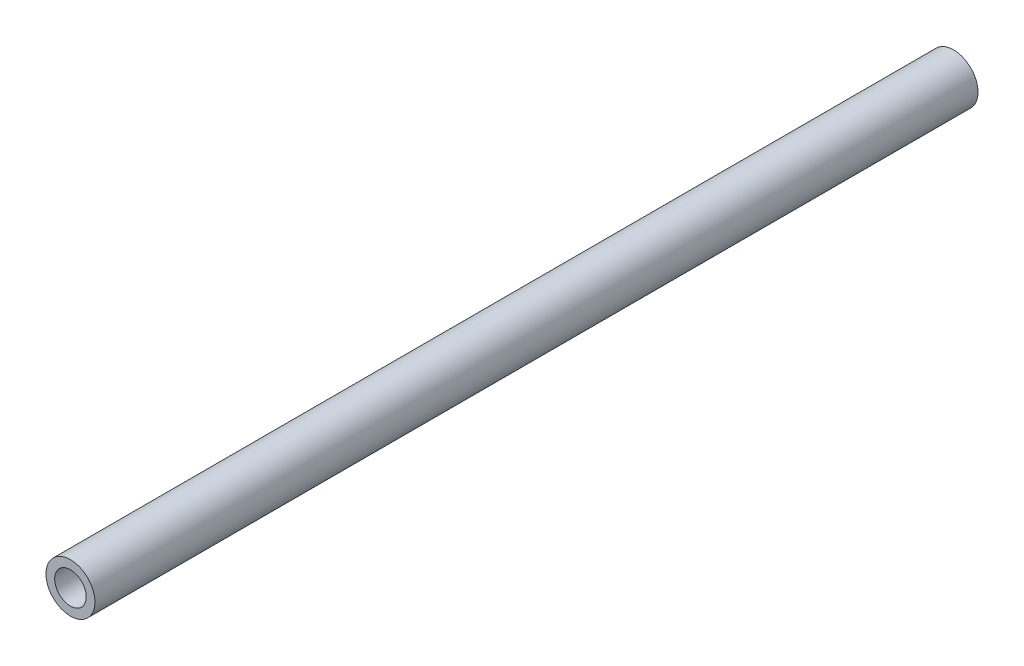
ISO-10303-21;
HEADER;
FILE_DESCRIPTION(('STEP AP214'),'2;1');
FILE_NAME('part.step','',(''),(''),'','','');
FILE_SCHEMA(('AUTOMOTIVE_DESIGN { 1 0 10303 214 1 1 1 1 }'));
ENDSEC;
DATA;
#1=APPLICATION_CONTEXT('core data for automotive mechanical design processes');
#2=APPLICATION_PROTOCOL_DEFINITION('international standard','automotive_design',2000,#1);
#3=PRODUCT_CONTEXT('',#1,'mechanical');
#4=PRODUCT('Part','Part','',(#3));
#5=PRODUCT_RELATED_PRODUCT_CATEGORY('part','',(#4));
#6=PRODUCT_DEFINITION_FORMATION('','',#4);
#7=PRODUCT_DEFINITION_CONTEXT('part definition',#1,'design');
#8=PRODUCT_DEFINITION('design','',#6,#7);
#9=PRODUCT_DEFINITION_SHAPE('','',#8);
#10=(LENGTH_UNIT() NAMED_UNIT(*) SI_UNIT(.MILLI.,.METRE.));
#11=(NAMED_UNIT(*) PLANE_ANGLE_UNIT() SI_UNIT($,.RADIAN.));
#12=(NAMED_UNIT(*) SI_UNIT($,.STERADIAN.) SOLID_ANGLE_UNIT());
#13=UNCERTAINTY_MEASURE_WITH_UNIT(LENGTH_MEASURE(1.E-05),#10,'distance_accuracy_value','');
#14=(GEOMETRIC_REPRESENTATION_CONTEXT(3) GLOBAL_UNCERTAINTY_ASSIGNED_CONTEXT((#13)) GLOBAL_UNIT_ASSIGNED_CONTEXT((#10,
#11,#12)) REPRESENTATION_CONTEXT('',''));
#15=CARTESIAN_POINT('',(0.,0.,0.));
#16=DIRECTION('',(0.,0.,1.));
#17=DIRECTION('',(1.,0.,0.));
#18=AXIS2_PLACEMENT_3D('',#15,#16,#17);
#19=CARTESIAN_POINT('',(0.,0.,35.));
#20=DIRECTION('',(0.,0.,1.));
#21=DIRECTION('',(1.,0.,0.));
#22=AXIS2_PLACEMENT_3D('',#19,#20,#21);
#23=PLANE('',#22);
#24=CARTESIAN_POINT('',(0.,0.,35.));
#25=DIRECTION('',(0.,0.,1.));
#26=DIRECTION('',(1.,0.,0.));
#27=AXIS2_PLACEMENT_3D('',#24,#25,#26);
#28=CIRCLE('',#27,0.97);
#29=CARTESIAN_POINT('',(0.97,0.,35.));
#30=VERTEX_POINT('',#29);
#31=EDGE_CURVE('E10',#30,#30,#28,.T.);
#32=ORIENTED_EDGE('',*,*,#31,.T.);
#33=EDGE_LOOP('',(#32));
#34=FACE_BOUND('',#33,.T.);
#35=CARTESIAN_POINT('',(0.,0.,35.));
#36=DIRECTION('',(0.,0.,1.));
#37=DIRECTION('',(1.,0.,0.));
#38=AXIS2_PLACEMENT_3D('',#35,#36,#37);
#39=CIRCLE('',#38,0.625);
#40=CARTESIAN_POINT('',(0.625,0.,35.));
#41=VERTEX_POINT('',#40);
#42=EDGE_CURVE('E42',#41,#41,#39,.T.);
#43=ORIENTED_EDGE('',*,*,#42,.F.);
#44=EDGE_LOOP('',(#43));
#45=FACE_BOUND('',#44,.T.);
#46=ADVANCED_FACE('F31',(#34,#45),#23,.T.);
#47=CARTESIAN_POINT('',(0.,0.,0.));
#48=DIRECTION('',(0.,0.,1.));
#49=DIRECTION('',(1.,0.,0.));
#50=AXIS2_PLACEMENT_3D('',#47,#48,#49);
#51=PLANE('',#50);
#52=CARTESIAN_POINT('',(0.,0.,0.));
#53=DIRECTION('',(0.,0.,1.));
#54=DIRECTION('',(1.,0.,0.));
#55=AXIS2_PLACEMENT_3D('',#52,#53,#54);
#56=CIRCLE('',#55,0.97);
#57=CARTESIAN_POINT('',(0.97,0.,0.));
#58=VERTEX_POINT('',#57);
#59=EDGE_CURVE('E35',#58,#58,#56,.T.);
#60=ORIENTED_EDGE('',*,*,#59,.F.);
#61=EDGE_LOOP('',(#60));
#62=FACE_BOUND('',#61,.T.);
#63=CARTESIAN_POINT('',(0.,0.,0.));
#64=DIRECTION('',(0.,0.,1.));
#65=DIRECTION('',(1.,0.,0.));
#66=AXIS2_PLACEMENT_3D('',#63,#64,#65);
#67=CIRCLE('',#66,0.625);
#68=CARTESIAN_POINT('',(0.625,0.,0.));
#69=VERTEX_POINT('',#68);
#70=EDGE_CURVE('E44',#69,#69,#67,.T.);
#71=ORIENTED_EDGE('',*,*,#70,.T.);
#72=EDGE_LOOP('',(#71));
#73=FACE_BOUND('',#72,.T.);
#74=ADVANCED_FACE('F54',(#62,#73),#51,.F.);
#75=CARTESIAN_POINT('',(0.,0.,35.));
#76=DIRECTION('',(0.,0.,-1.));
#77=DIRECTION('',(-1.,0.,0.));
#78=AXIS2_PLACEMENT_3D('',#75,#76,#77);
#79=CYLINDRICAL_SURFACE('',#78,0.97);
#80=ORIENTED_EDGE('',*,*,#31,.F.);
#81=EDGE_LOOP('',(#80));
#82=FACE_BOUND('',#81,.T.);
#83=ORIENTED_EDGE('',*,*,#59,.T.);
#84=EDGE_LOOP('',(#83));
#85=FACE_BOUND('',#84,.T.);
#86=ADVANCED_FACE('F33',(#82,#85),#79,.T.);
#87=CARTESIAN_POINT('',(0.,0.,35.));
#88=DIRECTION('',(0.,0.,-1.));
#89=DIRECTION('',(-1.,0.,0.));
#90=AXIS2_PLACEMENT_3D('',#87,#88,#89);
#91=CYLINDRICAL_SURFACE('',#90,0.625);
#92=ORIENTED_EDGE('',*,*,#42,.T.);
#93=EDGE_LOOP('',(#92));
#94=FACE_BOUND('',#93,.T.);
#95=ORIENTED_EDGE('',*,*,#70,.F.);
#96=EDGE_LOOP('',(#95));
#97=FACE_BOUND('',#96,.T.);
#98=ADVANCED_FACE('F50',(#94,#97),#91,.F.);
#99=CLOSED_SHELL('',(#46,#74,#86,#98));
#100=MANIFOLD_SOLID_BREP('B2',#99);
#101=ADVANCED_BREP_SHAPE_REPRESENTATION('',(#18,#100),#14);
#102=SHAPE_DEFINITION_REPRESENTATION(#9,#101);
ENDSEC;
END-ISO-10303-21;
